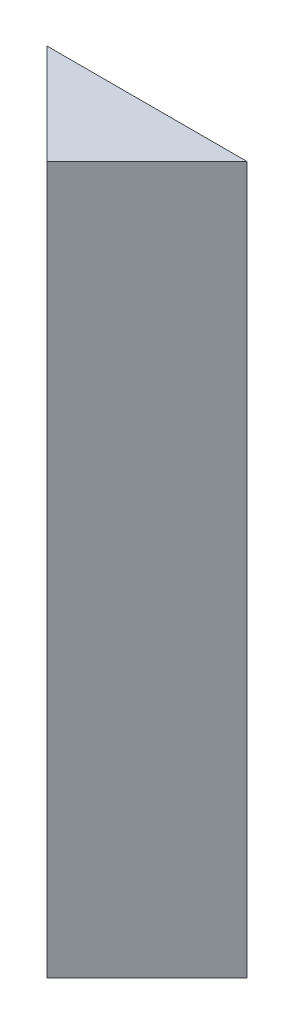
ISO-10303-21;
HEADER;
FILE_DESCRIPTION(('STEP AP214'),'2;1');
FILE_NAME('part.step','',(''),(''),'','','');
FILE_SCHEMA(('AUTOMOTIVE_DESIGN { 1 0 10303 214 1 1 1 1 }'));
ENDSEC;
DATA;
#1=APPLICATION_CONTEXT('core data for automotive mechanical design processes');
#2=APPLICATION_PROTOCOL_DEFINITION('international standard','automotive_design',2000,#1);
#3=PRODUCT_CONTEXT('',#1,'mechanical');
#4=PRODUCT('Part','Part','',(#3));
#5=PRODUCT_RELATED_PRODUCT_CATEGORY('part','',(#4));
#6=PRODUCT_DEFINITION_FORMATION('','',#4);
#7=PRODUCT_DEFINITION_CONTEXT('part definition',#1,'design');
#8=PRODUCT_DEFINITION('design','',#6,#7);
#9=PRODUCT_DEFINITION_SHAPE('','',#8);
#10=(LENGTH_UNIT() NAMED_UNIT(*) SI_UNIT(.MILLI.,.METRE.));
#11=(NAMED_UNIT(*) PLANE_ANGLE_UNIT() SI_UNIT($,.RADIAN.));
#12=(NAMED_UNIT(*) SI_UNIT($,.STERADIAN.) SOLID_ANGLE_UNIT());
#13=UNCERTAINTY_MEASURE_WITH_UNIT(LENGTH_MEASURE(1.E-05),#10,'distance_accuracy_value','');
#14=(GEOMETRIC_REPRESENTATION_CONTEXT(3) GLOBAL_UNCERTAINTY_ASSIGNED_CONTEXT((#13)) GLOBAL_UNIT_ASSIGNED_CONTEXT((#10,
#11,#12)) REPRESENTATION_CONTEXT('',''));
#15=CARTESIAN_POINT('',(0.,0.,0.));
#16=DIRECTION('',(0.,0.,1.));
#17=DIRECTION('',(1.,0.,0.));
#18=AXIS2_PLACEMENT_3D('',#15,#16,#17);
#19=CARTESIAN_POINT('',(4.24264068711928,15.,0.));
#20=DIRECTION('',(0.,0.,1.));
#21=DIRECTION('',(1.,0.,0.));
#22=AXIS2_PLACEMENT_3D('',#19,#20,#21);
#23=PLANE('',#22);
#24=DIRECTION('',(-1.,0.,0.));
#25=VECTOR('',#24,1.);
#26=CARTESIAN_POINT('',(4.24264068711928,0.,0.));
#27=LINE('',#26,#25);
#28=CARTESIAN_POINT('',(4.24264068711928,0.,0.));
#29=VERTEX_POINT('',#28);
#30=CARTESIAN_POINT('',(0.,0.,0.));
#31=VERTEX_POINT('',#30);
#32=EDGE_CURVE('E84',#29,#31,#27,.T.);
#33=ORIENTED_EDGE('',*,*,#32,.T.);
#34=DIRECTION('',(0.,-1.,0.));
#35=VECTOR('',#34,1.);
#36=CARTESIAN_POINT('',(0.,15.,0.));
#37=LINE('',#36,#35);
#38=CARTESIAN_POINT('',(0.,15.,0.));
#39=VERTEX_POINT('',#38);
#40=EDGE_CURVE('E11',#39,#31,#37,.T.);
#41=ORIENTED_EDGE('',*,*,#40,.F.);
#42=DIRECTION('',(-1.,0.,0.));
#43=VECTOR('',#42,1.);
#44=CARTESIAN_POINT('',(4.24264068711928,15.,0.));
#45=LINE('',#44,#43);
#46=CARTESIAN_POINT('',(4.24264068711928,15.,0.));
#47=VERTEX_POINT('',#46);
#48=EDGE_CURVE('E77',#47,#39,#45,.T.);
#49=ORIENTED_EDGE('',*,*,#48,.F.);
#50=DIRECTION('',(0.,-1.,0.));
#51=VECTOR('',#50,1.);
#52=CARTESIAN_POINT('',(4.24264068711928,15.,0.));
#53=LINE('',#52,#51);
#54=EDGE_CURVE('E85',#47,#29,#53,.T.);
#55=ORIENTED_EDGE('',*,*,#54,.T.);
#56=EDGE_LOOP('',(#33,#41,#49,#55));
#57=FACE_BOUND('',#56,.T.);
#58=ADVANCED_FACE('F37',(#57),#23,.F.);
#59=CARTESIAN_POINT('',(0.,15.,0.));
#60=DIRECTION('',(0.707106781186547,0.,-0.707106781186547));
#61=DIRECTION('',(-0.707106781186548,0.,-0.707106781186548));
#62=AXIS2_PLACEMENT_3D('',#59,#60,#61);
#63=PLANE('',#62);
#64=DIRECTION('',(0.707106781186548,0.,0.707106781186548));
#65=VECTOR('',#64,1.);
#66=CARTESIAN_POINT('',(0.,0.,0.));
#67=LINE('',#66,#65);
#68=CARTESIAN_POINT('',(2.12132034355964,0.,2.12132034355964));
#69=VERTEX_POINT('',#68);
#70=EDGE_CURVE('E65',#31,#69,#67,.T.);
#71=ORIENTED_EDGE('',*,*,#70,.T.);
#72=DIRECTION('',(0.,-1.,0.));
#73=VECTOR('',#72,1.);
#74=CARTESIAN_POINT('',(2.12132034355964,15.,2.12132034355964));
#75=LINE('',#74,#73);
#76=CARTESIAN_POINT('',(2.12132034355964,15.,2.12132034355964));
#77=VERTEX_POINT('',#76);
#78=EDGE_CURVE('E45',#77,#69,#75,.T.);
#79=ORIENTED_EDGE('',*,*,#78,.F.);
#80=DIRECTION('',(0.707106781186548,0.,0.707106781186548));
#81=VECTOR('',#80,1.);
#82=CARTESIAN_POINT('',(0.,15.,0.));
#83=LINE('',#82,#81);
#84=EDGE_CURVE('E73',#39,#77,#83,.T.);
#85=ORIENTED_EDGE('',*,*,#84,.F.);
#86=ORIENTED_EDGE('',*,*,#40,.T.);
#87=EDGE_LOOP('',(#71,#79,#85,#86));
#88=FACE_BOUND('',#87,.T.);
#89=ADVANCED_FACE('F74',(#88),#63,.F.);
#90=CARTESIAN_POINT('',(2.12132034355964,15.,2.12132034355964));
#91=DIRECTION('',(-0.707106781186549,0.,-0.707106781186547));
#92=DIRECTION('',(-0.707106781186547,0.,0.707106781186549));
#93=AXIS2_PLACEMENT_3D('',#90,#91,#92);
#94=PLANE('',#93);
#95=DIRECTION('',(0.707106781186547,0.,-0.707106781186549));
#96=VECTOR('',#95,1.);
#97=CARTESIAN_POINT('',(2.12132034355964,0.,2.12132034355964));
#98=LINE('',#97,#96);
#99=EDGE_CURVE('E70',#69,#29,#98,.T.);
#100=ORIENTED_EDGE('',*,*,#99,.T.);
#101=ORIENTED_EDGE('',*,*,#54,.F.);
#102=DIRECTION('',(0.707106781186547,0.,-0.707106781186549));
#103=VECTOR('',#102,1.);
#104=CARTESIAN_POINT('',(2.12132034355964,15.,2.12132034355964));
#105=LINE('',#104,#103);
#106=EDGE_CURVE('E53',#77,#47,#105,.T.);
#107=ORIENTED_EDGE('',*,*,#106,.F.);
#108=ORIENTED_EDGE('',*,*,#78,.T.);
#109=EDGE_LOOP('',(#100,#101,#107,#108));
#110=FACE_BOUND('',#109,.T.);
#111=ADVANCED_FACE('F92',(#110),#94,.F.);
#112=CARTESIAN_POINT('',(0.,15.,0.));
#113=DIRECTION('',(0.,1.,0.));
#114=DIRECTION('',(0.,0.,1.));
#115=AXIS2_PLACEMENT_3D('',#112,#113,#114);
#116=PLANE('',#115);
#117=ORIENTED_EDGE('',*,*,#48,.T.);
#118=ORIENTED_EDGE('',*,*,#84,.T.);
#119=ORIENTED_EDGE('',*,*,#106,.T.);
#120=EDGE_LOOP('',(#117,#118,#119));
#121=FACE_BOUND('',#120,.T.);
#122=ADVANCED_FACE('F80',(#121),#116,.T.);
#123=CARTESIAN_POINT('',(0.,0.,0.));
#124=DIRECTION('',(0.,1.,0.));
#125=DIRECTION('',(0.,0.,1.));
#126=AXIS2_PLACEMENT_3D('',#123,#124,#125);
#127=PLANE('',#126);
#128=ORIENTED_EDGE('',*,*,#32,.F.);
#129=ORIENTED_EDGE('',*,*,#99,.F.);
#130=ORIENTED_EDGE('',*,*,#70,.F.);
#131=EDGE_LOOP('',(#128,#129,#130));
#132=FACE_BOUND('',#131,.T.);
#133=ADVANCED_FACE('F93',(#132),#127,.F.);
#134=CLOSED_SHELL('',(#58,#89,#111,#122,#133));
#135=MANIFOLD_SOLID_BREP('B2',#134);
#136=ADVANCED_BREP_SHAPE_REPRESENTATION('',(#18,#135),#14);
#137=SHAPE_DEFINITION_REPRESENTATION(#9,#136);
ENDSEC;
END-ISO-10303-21;
